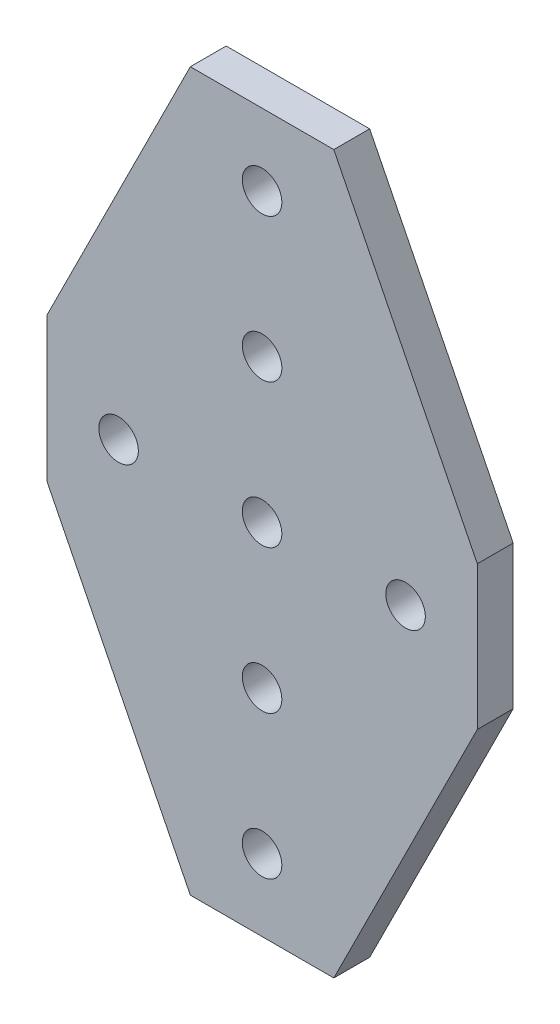
ISO-10303-21;
HEADER;
FILE_DESCRIPTION(('STEP AP214'),'2;1');
FILE_NAME('part.step','',(''),(''),'','','');
FILE_SCHEMA(('AUTOMOTIVE_DESIGN { 1 0 10303 214 1 1 1 1 }'));
ENDSEC;
DATA;
#1=APPLICATION_CONTEXT('core data for automotive mechanical design processes');
#2=APPLICATION_PROTOCOL_DEFINITION('international standard','automotive_design',2000,#1);
#3=PRODUCT_CONTEXT('',#1,'mechanical');
#4=PRODUCT('Part','Part','',(#3));
#5=PRODUCT_RELATED_PRODUCT_CATEGORY('part','',(#4));
#6=PRODUCT_DEFINITION_FORMATION('','',#4);
#7=PRODUCT_DEFINITION_CONTEXT('part definition',#1,'design');
#8=PRODUCT_DEFINITION('design','',#6,#7);
#9=PRODUCT_DEFINITION_SHAPE('','',#8);
#10=(LENGTH_UNIT() NAMED_UNIT(*) SI_UNIT(.MILLI.,.METRE.));
#11=(NAMED_UNIT(*) PLANE_ANGLE_UNIT() SI_UNIT($,.RADIAN.));
#12=(NAMED_UNIT(*) SI_UNIT($,.STERADIAN.) SOLID_ANGLE_UNIT());
#13=UNCERTAINTY_MEASURE_WITH_UNIT(LENGTH_MEASURE(1.E-05),#10,'distance_accuracy_value','');
#14=(GEOMETRIC_REPRESENTATION_CONTEXT(3) GLOBAL_UNCERTAINTY_ASSIGNED_CONTEXT((#13)) GLOBAL_UNIT_ASSIGNED_CONTEXT((#10,
#11,#12)) REPRESENTATION_CONTEXT('',''));
#15=CARTESIAN_POINT('',(0.,0.,0.));
#16=DIRECTION('',(0.,0.,1.));
#17=DIRECTION('',(1.,0.,0.));
#18=AXIS2_PLACEMENT_3D('',#15,#16,#17);
#19=CARTESIAN_POINT('',(0.,0.,6.35));
#20=DIRECTION('',(0.894427190999916,0.447213595499958,0.));
#21=DIRECTION('',(-0.447213595499958,0.894427190999916,0.));
#22=AXIS2_PLACEMENT_3D('',#19,#20,#21);
#23=PLANE('',#22);
#24=DIRECTION('',(0.447213595499958,-0.894427190999916,0.));
#25=VECTOR('',#24,1.);
#26=CARTESIAN_POINT('',(0.,0.,0.));
#27=LINE('',#26,#25);
#28=CARTESIAN_POINT('',(-25.4,50.8,0.));
#29=VERTEX_POINT('',#28);
#30=CARTESIAN_POINT('',(0.,0.,0.));
#31=VERTEX_POINT('',#30);
#32=EDGE_CURVE('E130',#29,#31,#27,.T.);
#33=ORIENTED_EDGE('',*,*,#32,.T.);
#34=DIRECTION('',(0.,0.,-1.));
#35=VECTOR('',#34,1.);
#36=CARTESIAN_POINT('',(0.,0.,6.35));
#37=LINE('',#36,#35);
#38=CARTESIAN_POINT('',(0.,0.,6.35));
#39=VERTEX_POINT('',#38);
#40=EDGE_CURVE('E11',#39,#31,#37,.T.);
#41=ORIENTED_EDGE('',*,*,#40,.F.);
#42=DIRECTION('',(0.447213595499958,-0.894427190999916,0.));
#43=VECTOR('',#42,1.);
#44=CARTESIAN_POINT('',(0.,0.,6.35));
#45=LINE('',#44,#43);
#46=CARTESIAN_POINT('',(-25.4,50.8,6.35));
#47=VERTEX_POINT('',#46);
#48=EDGE_CURVE('E145',#47,#39,#45,.T.);
#49=ORIENTED_EDGE('',*,*,#48,.F.);
#50=DIRECTION('',(0.,0.,-1.));
#51=VECTOR('',#50,1.);
#52=CARTESIAN_POINT('',(-25.4,50.8,6.35));
#53=LINE('',#52,#51);
#54=EDGE_CURVE('E126',#47,#29,#53,.T.);
#55=ORIENTED_EDGE('',*,*,#54,.T.);
#56=EDGE_LOOP('',(#33,#41,#49,#55));
#57=FACE_BOUND('',#56,.T.);
#58=ADVANCED_FACE('F34',(#57),#23,.F.);
#59=CARTESIAN_POINT('',(25.4,0.,6.35));
#60=DIRECTION('',(0.,1.,0.));
#61=DIRECTION('',(-1.,0.,0.));
#62=AXIS2_PLACEMENT_3D('',#59,#60,#61);
#63=PLANE('',#62);
#64=DIRECTION('',(1.,0.,0.));
#65=VECTOR('',#64,1.);
#66=CARTESIAN_POINT('',(25.4,0.,0.));
#67=LINE('',#66,#65);
#68=CARTESIAN_POINT('',(25.4,0.,0.));
#69=VERTEX_POINT('',#68);
#70=EDGE_CURVE('E133',#31,#69,#67,.T.);
#71=ORIENTED_EDGE('',*,*,#70,.T.);
#72=DIRECTION('',(0.,0.,-1.));
#73=VECTOR('',#72,1.);
#74=CARTESIAN_POINT('',(25.4,0.,6.35));
#75=LINE('',#74,#73);
#76=CARTESIAN_POINT('',(25.4,0.,6.35));
#77=VERTEX_POINT('',#76);
#78=EDGE_CURVE('E42',#77,#69,#75,.T.);
#79=ORIENTED_EDGE('',*,*,#78,.F.);
#80=DIRECTION('',(1.,0.,0.));
#81=VECTOR('',#80,1.);
#82=CARTESIAN_POINT('',(25.4,0.,6.35));
#83=LINE('',#82,#81);
#84=EDGE_CURVE('E93',#39,#77,#83,.T.);
#85=ORIENTED_EDGE('',*,*,#84,.F.);
#86=ORIENTED_EDGE('',*,*,#40,.T.);
#87=EDGE_LOOP('',(#71,#79,#85,#86));
#88=FACE_BOUND('',#87,.T.);
#89=ADVANCED_FACE('F248',(#88),#63,.F.);
#90=CARTESIAN_POINT('',(50.8,50.8,6.35));
#91=DIRECTION('',(-0.894427190999916,0.447213595499958,0.));
#92=DIRECTION('',(-0.447213595499958,-0.894427190999916,0.));
#93=AXIS2_PLACEMENT_3D('',#90,#91,#92);
#94=PLANE('',#93);
#95=DIRECTION('',(0.447213595499958,0.894427190999916,0.));
#96=VECTOR('',#95,1.);
#97=CARTESIAN_POINT('',(50.8,50.8,0.));
#98=LINE('',#97,#96);
#99=CARTESIAN_POINT('',(50.8,50.8,0.));
#100=VERTEX_POINT('',#99);
#101=EDGE_CURVE('E136',#69,#100,#98,.T.);
#102=ORIENTED_EDGE('',*,*,#101,.T.);
#103=DIRECTION('',(0.,0.,-1.));
#104=VECTOR('',#103,1.);
#105=CARTESIAN_POINT('',(50.8,50.8,6.35));
#106=LINE('',#105,#104);
#107=CARTESIAN_POINT('',(50.8,50.8,6.35));
#108=VERTEX_POINT('',#107);
#109=EDGE_CURVE('E152',#108,#100,#106,.T.);
#110=ORIENTED_EDGE('',*,*,#109,.F.);
#111=DIRECTION('',(0.447213595499958,0.894427190999916,0.));
#112=VECTOR('',#111,1.);
#113=CARTESIAN_POINT('',(50.8,50.8,6.35));
#114=LINE('',#113,#112);
#115=EDGE_CURVE('E160',#77,#108,#114,.T.);
#116=ORIENTED_EDGE('',*,*,#115,.F.);
#117=ORIENTED_EDGE('',*,*,#78,.T.);
#118=EDGE_LOOP('',(#102,#110,#116,#117));
#119=FACE_BOUND('',#118,.T.);
#120=ADVANCED_FACE('F158',(#119),#94,.F.);
#121=CARTESIAN_POINT('',(50.8,76.2,6.35));
#122=DIRECTION('',(-1.,0.,0.));
#123=DIRECTION('',(0.,-1.,0.));
#124=AXIS2_PLACEMENT_3D('',#121,#122,#123);
#125=PLANE('',#124);
#126=DIRECTION('',(0.,1.,0.));
#127=VECTOR('',#126,1.);
#128=CARTESIAN_POINT('',(50.8,76.2,0.));
#129=LINE('',#128,#127);
#130=CARTESIAN_POINT('',(50.8,76.2,0.));
#131=VERTEX_POINT('',#130);
#132=EDGE_CURVE('E138',#100,#131,#129,.T.);
#133=ORIENTED_EDGE('',*,*,#132,.T.);
#134=DIRECTION('',(0.,0.,-1.));
#135=VECTOR('',#134,1.);
#136=CARTESIAN_POINT('',(50.8,76.2,6.35));
#137=LINE('',#136,#135);
#138=CARTESIAN_POINT('',(50.8,76.2,6.35));
#139=VERTEX_POINT('',#138);
#140=EDGE_CURVE('E149',#139,#131,#137,.T.);
#141=ORIENTED_EDGE('',*,*,#140,.F.);
#142=DIRECTION('',(0.,1.,0.));
#143=VECTOR('',#142,1.);
#144=CARTESIAN_POINT('',(50.8,76.2,6.35));
#145=LINE('',#144,#143);
#146=EDGE_CURVE('E172',#108,#139,#145,.T.);
#147=ORIENTED_EDGE('',*,*,#146,.F.);
#148=ORIENTED_EDGE('',*,*,#109,.T.);
#149=EDGE_LOOP('',(#133,#141,#147,#148));
#150=FACE_BOUND('',#149,.T.);
#151=ADVANCED_FACE('F168',(#150),#125,.F.);
#152=CARTESIAN_POINT('',(25.4,127.,6.35));
#153=DIRECTION('',(-0.894427190999916,-0.447213595499958,0.));
#154=DIRECTION('',(0.447213595499958,-0.894427190999916,0.));
#155=AXIS2_PLACEMENT_3D('',#152,#153,#154);
#156=PLANE('',#155);
#157=DIRECTION('',(-0.447213595499958,0.894427190999916,0.));
#158=VECTOR('',#157,1.);
#159=CARTESIAN_POINT('',(25.4,127.,0.));
#160=LINE('',#159,#158);
#161=CARTESIAN_POINT('',(25.4,127.,0.));
#162=VERTEX_POINT('',#161);
#163=EDGE_CURVE('E140',#131,#162,#160,.T.);
#164=ORIENTED_EDGE('',*,*,#163,.T.);
#165=DIRECTION('',(0.,0.,-1.));
#166=VECTOR('',#165,1.);
#167=CARTESIAN_POINT('',(25.4,127.,6.35));
#168=LINE('',#167,#166);
#169=CARTESIAN_POINT('',(25.4,127.,6.35));
#170=VERTEX_POINT('',#169);
#171=EDGE_CURVE('E121',#170,#162,#168,.T.);
#172=ORIENTED_EDGE('',*,*,#171,.F.);
#173=DIRECTION('',(-0.447213595499958,0.894427190999916,0.));
#174=VECTOR('',#173,1.);
#175=CARTESIAN_POINT('',(25.4,127.,6.35));
#176=LINE('',#175,#174);
#177=EDGE_CURVE('E112',#139,#170,#176,.T.);
#178=ORIENTED_EDGE('',*,*,#177,.F.);
#179=ORIENTED_EDGE('',*,*,#140,.T.);
#180=EDGE_LOOP('',(#164,#172,#178,#179));
#181=FACE_BOUND('',#180,.T.);
#182=ADVANCED_FACE('F171',(#181),#156,.F.);
#183=CARTESIAN_POINT('',(0.,127.,6.35));
#184=DIRECTION('',(0.,-1.,0.));
#185=DIRECTION('',(0.,0.,-1.));
#186=AXIS2_PLACEMENT_3D('',#183,#184,#185);
#187=PLANE('',#186);
#188=DIRECTION('',(-1.,0.,0.));
#189=VECTOR('',#188,1.);
#190=CARTESIAN_POINT('',(0.,127.,0.));
#191=LINE('',#190,#189);
#192=CARTESIAN_POINT('',(0.,127.,0.));
#193=VERTEX_POINT('',#192);
#194=EDGE_CURVE('E120',#162,#193,#191,.T.);
#195=ORIENTED_EDGE('',*,*,#194,.T.);
#196=DIRECTION('',(0.,0.,-1.));
#197=VECTOR('',#196,1.);
#198=CARTESIAN_POINT('',(0.,127.,6.35));
#199=LINE('',#198,#197);
#200=CARTESIAN_POINT('',(0.,127.,6.35));
#201=VERTEX_POINT('',#200);
#202=EDGE_CURVE('E117',#201,#193,#199,.T.);
#203=ORIENTED_EDGE('',*,*,#202,.F.);
#204=DIRECTION('',(-1.,0.,0.));
#205=VECTOR('',#204,1.);
#206=CARTESIAN_POINT('',(0.,127.,6.35));
#207=LINE('',#206,#205);
#208=EDGE_CURVE('E106',#170,#201,#207,.T.);
#209=ORIENTED_EDGE('',*,*,#208,.F.);
#210=ORIENTED_EDGE('',*,*,#171,.T.);
#211=EDGE_LOOP('',(#195,#203,#209,#210));
#212=FACE_BOUND('',#211,.T.);
#213=ADVANCED_FACE('F118',(#212),#187,.F.);
#214=CARTESIAN_POINT('',(-25.4,76.2,6.35));
#215=DIRECTION('',(0.894427190999916,-0.447213595499958,0.));
#216=DIRECTION('',(0.447213595499958,0.894427190999916,0.));
#217=AXIS2_PLACEMENT_3D('',#214,#215,#216);
#218=PLANE('',#217);
#219=DIRECTION('',(-0.447213595499958,-0.894427190999916,0.));
#220=VECTOR('',#219,1.);
#221=CARTESIAN_POINT('',(-25.4,76.2,0.));
#222=LINE('',#221,#220);
#223=CARTESIAN_POINT('',(-25.4,76.2,0.));
#224=VERTEX_POINT('',#223);
#225=EDGE_CURVE('E79',#193,#224,#222,.T.);
#226=ORIENTED_EDGE('',*,*,#225,.T.);
#227=DIRECTION('',(0.,0.,-1.));
#228=VECTOR('',#227,1.);
#229=CARTESIAN_POINT('',(-25.4,76.2,6.35));
#230=LINE('',#229,#228);
#231=CARTESIAN_POINT('',(-25.4,76.2,6.35));
#232=VERTEX_POINT('',#231);
#233=EDGE_CURVE('E122',#232,#224,#230,.T.);
#234=ORIENTED_EDGE('',*,*,#233,.F.);
#235=DIRECTION('',(-0.447213595499958,-0.894427190999916,0.));
#236=VECTOR('',#235,1.);
#237=CARTESIAN_POINT('',(-25.4,76.2,6.35));
#238=LINE('',#237,#236);
#239=EDGE_CURVE('E110',#201,#232,#238,.T.);
#240=ORIENTED_EDGE('',*,*,#239,.F.);
#241=ORIENTED_EDGE('',*,*,#202,.T.);
#242=EDGE_LOOP('',(#226,#234,#240,#241));
#243=FACE_BOUND('',#242,.T.);
#244=ADVANCED_FACE('F124',(#243),#218,.F.);
#245=CARTESIAN_POINT('',(-25.4,50.8,6.35));
#246=DIRECTION('',(1.,0.,0.));
#247=DIRECTION('',(0.,0.,-1.));
#248=AXIS2_PLACEMENT_3D('',#245,#246,#247);
#249=PLANE('',#248);
#250=DIRECTION('',(0.,-1.,0.));
#251=VECTOR('',#250,1.);
#252=CARTESIAN_POINT('',(-25.4,50.8,0.));
#253=LINE('',#252,#251);
#254=EDGE_CURVE('E85',#224,#29,#253,.T.);
#255=ORIENTED_EDGE('',*,*,#254,.T.);
#256=ORIENTED_EDGE('',*,*,#54,.F.);
#257=DIRECTION('',(0.,-1.,0.));
#258=VECTOR('',#257,1.);
#259=CARTESIAN_POINT('',(-25.4,50.8,6.35));
#260=LINE('',#259,#258);
#261=EDGE_CURVE('E50',#232,#47,#260,.T.);
#262=ORIENTED_EDGE('',*,*,#261,.F.);
#263=ORIENTED_EDGE('',*,*,#233,.T.);
#264=EDGE_LOOP('',(#255,#256,#262,#263));
#265=FACE_BOUND('',#264,.T.);
#266=ADVANCED_FACE('F232',(#265),#249,.F.);
#267=CARTESIAN_POINT('',(0.,0.,6.35));
#268=DIRECTION('',(0.,0.,-1.));
#269=DIRECTION('',(-1.,0.,0.));
#270=AXIS2_PLACEMENT_3D('',#267,#268,#269);
#271=PLANE('',#270);
#272=CARTESIAN_POINT('',(12.7000000000003,88.9,6.35));
#273=DIRECTION('',(0.,0.,1.));
#274=DIRECTION('',(-1.,0.,0.));
#275=AXIS2_PLACEMENT_3D('',#272,#273,#274);
#276=CIRCLE('',#275,3.5);
#277=CARTESIAN_POINT('',(9.20000000000027,88.9,6.35));
#278=VERTEX_POINT('',#277);
#279=EDGE_CURVE('E184',#278,#278,#276,.T.);
#280=ORIENTED_EDGE('',*,*,#279,.F.);
#281=EDGE_LOOP('',(#280));
#282=FACE_BOUND('',#281,.T.);
#283=CARTESIAN_POINT('',(12.7000000000005,114.3,6.35));
#284=DIRECTION('',(0.,0.,1.));
#285=DIRECTION('',(-1.,0.,0.));
#286=AXIS2_PLACEMENT_3D('',#283,#284,#285);
#287=CIRCLE('',#286,3.5);
#288=CARTESIAN_POINT('',(9.20000000000053,114.3,6.35));
#289=VERTEX_POINT('',#288);
#290=EDGE_CURVE('E190',#289,#289,#287,.T.);
#291=ORIENTED_EDGE('',*,*,#290,.F.);
#292=EDGE_LOOP('',(#291));
#293=FACE_BOUND('',#292,.T.);
#294=CARTESIAN_POINT('',(12.7000000000005,12.7,6.35));
#295=DIRECTION('',(0.,0.,1.));
#296=DIRECTION('',(1.,0.,0.));
#297=AXIS2_PLACEMENT_3D('',#294,#295,#296);
#298=CIRCLE('',#297,3.5);
#299=CARTESIAN_POINT('',(16.2000000000005,12.7,6.35));
#300=VERTEX_POINT('',#299);
#301=EDGE_CURVE('E196',#300,#300,#298,.T.);
#302=ORIENTED_EDGE('',*,*,#301,.F.);
#303=EDGE_LOOP('',(#302));
#304=FACE_BOUND('',#303,.T.);
#305=CARTESIAN_POINT('',(12.7000000000003,38.1,6.35));
#306=DIRECTION('',(0.,0.,1.));
#307=DIRECTION('',(1.,0.,0.));
#308=AXIS2_PLACEMENT_3D('',#305,#306,#307);
#309=CIRCLE('',#308,3.5);
#310=CARTESIAN_POINT('',(16.2000000000003,38.1,6.35));
#311=VERTEX_POINT('',#310);
#312=EDGE_CURVE('E202',#311,#311,#309,.T.);
#313=ORIENTED_EDGE('',*,*,#312,.F.);
#314=EDGE_LOOP('',(#313));
#315=FACE_BOUND('',#314,.T.);
#316=CARTESIAN_POINT('',(-12.7,63.5000000000004,6.35));
#317=DIRECTION('',(0.,0.,1.));
#318=DIRECTION('',(-1.,0.,0.));
#319=AXIS2_PLACEMENT_3D('',#316,#317,#318);
#320=CIRCLE('',#319,3.5);
#321=CARTESIAN_POINT('',(-16.2,63.5000000000004,6.35));
#322=VERTEX_POINT('',#321);
#323=EDGE_CURVE('E208',#322,#322,#320,.T.);
#324=ORIENTED_EDGE('',*,*,#323,.F.);
#325=EDGE_LOOP('',(#324));
#326=FACE_BOUND('',#325,.T.);
#327=CARTESIAN_POINT('',(38.1,63.5000000000004,6.35));
#328=DIRECTION('',(0.,0.,1.));
#329=DIRECTION('',(1.,0.,0.));
#330=AXIS2_PLACEMENT_3D('',#327,#328,#329);
#331=CIRCLE('',#330,3.5);
#332=CARTESIAN_POINT('',(41.6,63.5000000000004,6.35));
#333=VERTEX_POINT('',#332);
#334=EDGE_CURVE('E214',#333,#333,#331,.T.);
#335=ORIENTED_EDGE('',*,*,#334,.F.);
#336=EDGE_LOOP('',(#335));
#337=FACE_BOUND('',#336,.T.);
#338=CARTESIAN_POINT('',(12.7,63.5,6.35));
#339=DIRECTION('',(0.,0.,1.));
#340=DIRECTION('',(1.,0.,0.));
#341=AXIS2_PLACEMENT_3D('',#338,#339,#340);
#342=CIRCLE('',#341,3.5);
#343=CARTESIAN_POINT('',(16.2,63.5,6.35));
#344=VERTEX_POINT('',#343);
#345=EDGE_CURVE('E178',#344,#344,#342,.T.);
#346=ORIENTED_EDGE('',*,*,#345,.F.);
#347=EDGE_LOOP('',(#346));
#348=FACE_BOUND('',#347,.T.);
#349=ORIENTED_EDGE('',*,*,#48,.T.);
#350=ORIENTED_EDGE('',*,*,#84,.T.);
#351=ORIENTED_EDGE('',*,*,#115,.T.);
#352=ORIENTED_EDGE('',*,*,#146,.T.);
#353=ORIENTED_EDGE('',*,*,#177,.T.);
#354=ORIENTED_EDGE('',*,*,#208,.T.);
#355=ORIENTED_EDGE('',*,*,#239,.T.);
#356=ORIENTED_EDGE('',*,*,#261,.T.);
#357=EDGE_LOOP('',(#349,#350,#351,#352,#353,#354,#355,#356));
#358=FACE_BOUND('',#357,.T.);
#359=ADVANCED_FACE('F108',(#282,#293,#304,#315,#326,#337,#348,#358),#271,.F.);
#360=CARTESIAN_POINT('',(0.,0.,0.));
#361=DIRECTION('',(0.,0.,-1.));
#362=DIRECTION('',(-1.,0.,0.));
#363=AXIS2_PLACEMENT_3D('',#360,#361,#362);
#364=PLANE('',#363);
#365=CARTESIAN_POINT('',(12.7000000000003,88.9,0.));
#366=DIRECTION('',(0.,0.,1.));
#367=DIRECTION('',(-1.,0.,0.));
#368=AXIS2_PLACEMENT_3D('',#365,#366,#367);
#369=CIRCLE('',#368,3.5);
#370=CARTESIAN_POINT('',(9.20000000000027,88.9,0.));
#371=VERTEX_POINT('',#370);
#372=EDGE_CURVE('E187',#371,#371,#369,.T.);
#373=ORIENTED_EDGE('',*,*,#372,.T.);
#374=EDGE_LOOP('',(#373));
#375=FACE_BOUND('',#374,.T.);
#376=CARTESIAN_POINT('',(12.7000000000005,114.3,0.));
#377=DIRECTION('',(0.,0.,1.));
#378=DIRECTION('',(-1.,0.,0.));
#379=AXIS2_PLACEMENT_3D('',#376,#377,#378);
#380=CIRCLE('',#379,3.5);
#381=CARTESIAN_POINT('',(9.20000000000053,114.3,0.));
#382=VERTEX_POINT('',#381);
#383=EDGE_CURVE('E193',#382,#382,#380,.T.);
#384=ORIENTED_EDGE('',*,*,#383,.T.);
#385=EDGE_LOOP('',(#384));
#386=FACE_BOUND('',#385,.T.);
#387=CARTESIAN_POINT('',(12.7000000000005,12.7,0.));
#388=DIRECTION('',(0.,0.,1.));
#389=DIRECTION('',(1.,0.,0.));
#390=AXIS2_PLACEMENT_3D('',#387,#388,#389);
#391=CIRCLE('',#390,3.5);
#392=CARTESIAN_POINT('',(16.2000000000005,12.7,0.));
#393=VERTEX_POINT('',#392);
#394=EDGE_CURVE('E199',#393,#393,#391,.T.);
#395=ORIENTED_EDGE('',*,*,#394,.T.);
#396=EDGE_LOOP('',(#395));
#397=FACE_BOUND('',#396,.T.);
#398=CARTESIAN_POINT('',(12.7000000000003,38.1,0.));
#399=DIRECTION('',(0.,0.,1.));
#400=DIRECTION('',(1.,0.,0.));
#401=AXIS2_PLACEMENT_3D('',#398,#399,#400);
#402=CIRCLE('',#401,3.5);
#403=CARTESIAN_POINT('',(16.2000000000003,38.1,0.));
#404=VERTEX_POINT('',#403);
#405=EDGE_CURVE('E205',#404,#404,#402,.T.);
#406=ORIENTED_EDGE('',*,*,#405,.T.);
#407=EDGE_LOOP('',(#406));
#408=FACE_BOUND('',#407,.T.);
#409=CARTESIAN_POINT('',(-12.7,63.5000000000004,0.));
#410=DIRECTION('',(0.,0.,1.));
#411=DIRECTION('',(-1.,0.,0.));
#412=AXIS2_PLACEMENT_3D('',#409,#410,#411);
#413=CIRCLE('',#412,3.5);
#414=CARTESIAN_POINT('',(-16.2,63.5000000000004,0.));
#415=VERTEX_POINT('',#414);
#416=EDGE_CURVE('E211',#415,#415,#413,.T.);
#417=ORIENTED_EDGE('',*,*,#416,.T.);
#418=EDGE_LOOP('',(#417));
#419=FACE_BOUND('',#418,.T.);
#420=CARTESIAN_POINT('',(38.1,63.5000000000004,0.));
#421=DIRECTION('',(0.,0.,1.));
#422=DIRECTION('',(1.,0.,0.));
#423=AXIS2_PLACEMENT_3D('',#420,#421,#422);
#424=CIRCLE('',#423,3.5);
#425=CARTESIAN_POINT('',(41.6,63.5000000000004,0.));
#426=VERTEX_POINT('',#425);
#427=EDGE_CURVE('E181',#426,#426,#424,.T.);
#428=ORIENTED_EDGE('',*,*,#427,.T.);
#429=EDGE_LOOP('',(#428));
#430=FACE_BOUND('',#429,.T.);
#431=CARTESIAN_POINT('',(12.7,63.5,0.));
#432=DIRECTION('',(0.,0.,1.));
#433=DIRECTION('',(1.,0.,0.));
#434=AXIS2_PLACEMENT_3D('',#431,#432,#433);
#435=CIRCLE('',#434,3.5);
#436=CARTESIAN_POINT('',(16.2,63.5,0.));
#437=VERTEX_POINT('',#436);
#438=EDGE_CURVE('E134',#437,#437,#435,.T.);
#439=ORIENTED_EDGE('',*,*,#438,.T.);
#440=EDGE_LOOP('',(#439));
#441=FACE_BOUND('',#440,.T.);
#442=ORIENTED_EDGE('',*,*,#32,.F.);
#443=ORIENTED_EDGE('',*,*,#254,.F.);
#444=ORIENTED_EDGE('',*,*,#225,.F.);
#445=ORIENTED_EDGE('',*,*,#194,.F.);
#446=ORIENTED_EDGE('',*,*,#163,.F.);
#447=ORIENTED_EDGE('',*,*,#132,.F.);
#448=ORIENTED_EDGE('',*,*,#101,.F.);
#449=ORIENTED_EDGE('',*,*,#70,.F.);
#450=EDGE_LOOP('',(#442,#443,#444,#445,#446,#447,#448,#449));
#451=FACE_BOUND('',#450,.T.);
#452=ADVANCED_FACE('F164',(#375,#386,#397,#408,#419,#430,#441,#451),#364,.T.);
#453=CARTESIAN_POINT('',(12.7,63.5,0.));
#454=DIRECTION('',(0.,0.,1.));
#455=DIRECTION('',(1.,0.,0.));
#456=AXIS2_PLACEMENT_3D('',#453,#454,#455);
#457=CYLINDRICAL_SURFACE('',#456,3.5);
#458=ORIENTED_EDGE('',*,*,#438,.F.);
#459=EDGE_LOOP('',(#458));
#460=FACE_BOUND('',#459,.T.);
#461=ORIENTED_EDGE('',*,*,#345,.T.);
#462=EDGE_LOOP('',(#461));
#463=FACE_BOUND('',#462,.T.);
#464=ADVANCED_FACE('F226',(#460,#463),#457,.F.);
#465=CARTESIAN_POINT('',(38.1,63.5000000000004,0.));
#466=DIRECTION('',(0.,0.,1.));
#467=DIRECTION('',(1.,0.,0.));
#468=AXIS2_PLACEMENT_3D('',#465,#466,#467);
#469=CYLINDRICAL_SURFACE('',#468,3.5);
#470=ORIENTED_EDGE('',*,*,#427,.F.);
#471=EDGE_LOOP('',(#470));
#472=FACE_BOUND('',#471,.T.);
#473=ORIENTED_EDGE('',*,*,#334,.T.);
#474=EDGE_LOOP('',(#473));
#475=FACE_BOUND('',#474,.T.);
#476=ADVANCED_FACE('F222',(#472,#475),#469,.F.);
#477=CARTESIAN_POINT('',(-12.7,63.5000000000004,0.));
#478=DIRECTION('',(0.,0.,1.));
#479=DIRECTION('',(1.,0.,0.));
#480=AXIS2_PLACEMENT_3D('',#477,#478,#479);
#481=CYLINDRICAL_SURFACE('',#480,3.5);
#482=ORIENTED_EDGE('',*,*,#416,.F.);
#483=EDGE_LOOP('',(#482));
#484=FACE_BOUND('',#483,.T.);
#485=ORIENTED_EDGE('',*,*,#323,.T.);
#486=EDGE_LOOP('',(#485));
#487=FACE_BOUND('',#486,.T.);
#488=ADVANCED_FACE('F225',(#484,#487),#481,.F.);
#489=CARTESIAN_POINT('',(12.7000000000003,38.1,0.));
#490=DIRECTION('',(0.,0.,1.));
#491=DIRECTION('',(1.,0.,0.));
#492=AXIS2_PLACEMENT_3D('',#489,#490,#491);
#493=CYLINDRICAL_SURFACE('',#492,3.5);
#494=ORIENTED_EDGE('',*,*,#405,.F.);
#495=EDGE_LOOP('',(#494));
#496=FACE_BOUND('',#495,.T.);
#497=ORIENTED_EDGE('',*,*,#312,.T.);
#498=EDGE_LOOP('',(#497));
#499=FACE_BOUND('',#498,.T.);
#500=ADVANCED_FACE('F324',(#496,#499),#493,.F.);
#501=CARTESIAN_POINT('',(12.7000000000005,12.7,0.));
#502=DIRECTION('',(0.,0.,1.));
#503=DIRECTION('',(1.,0.,0.));
#504=AXIS2_PLACEMENT_3D('',#501,#502,#503);
#505=CYLINDRICAL_SURFACE('',#504,3.5);
#506=ORIENTED_EDGE('',*,*,#394,.F.);
#507=EDGE_LOOP('',(#506));
#508=FACE_BOUND('',#507,.T.);
#509=ORIENTED_EDGE('',*,*,#301,.T.);
#510=EDGE_LOOP('',(#509));
#511=FACE_BOUND('',#510,.T.);
#512=ADVANCED_FACE('F334',(#508,#511),#505,.F.);
#513=CARTESIAN_POINT('',(12.7000000000005,114.3,0.));
#514=DIRECTION('',(0.,0.,1.));
#515=DIRECTION('',(1.,0.,0.));
#516=AXIS2_PLACEMENT_3D('',#513,#514,#515);
#517=CYLINDRICAL_SURFACE('',#516,3.5);
#518=ORIENTED_EDGE('',*,*,#383,.F.);
#519=EDGE_LOOP('',(#518));
#520=FACE_BOUND('',#519,.T.);
#521=ORIENTED_EDGE('',*,*,#290,.T.);
#522=EDGE_LOOP('',(#521));
#523=FACE_BOUND('',#522,.T.);
#524=ADVANCED_FACE('F344',(#520,#523),#517,.F.);
#525=CARTESIAN_POINT('',(12.7000000000003,88.9,0.));
#526=DIRECTION('',(0.,0.,1.));
#527=DIRECTION('',(1.,0.,0.));
#528=AXIS2_PLACEMENT_3D('',#525,#526,#527);
#529=CYLINDRICAL_SURFACE('',#528,3.5);
#530=ORIENTED_EDGE('',*,*,#372,.F.);
#531=EDGE_LOOP('',(#530));
#532=FACE_BOUND('',#531,.T.);
#533=ORIENTED_EDGE('',*,*,#279,.T.);
#534=EDGE_LOOP('',(#533));
#535=FACE_BOUND('',#534,.T.);
#536=ADVANCED_FACE('F354',(#532,#535),#529,.F.);
#537=CLOSED_SHELL('',(#58,#89,#120,#151,#182,#213,#244,#266,#359,#452,#464,#476,#488,#500,#512,
#524,#536));
#538=MANIFOLD_SOLID_BREP('B2',#537);
#539=ADVANCED_BREP_SHAPE_REPRESENTATION('',(#18,#538),#14);
#540=SHAPE_DEFINITION_REPRESENTATION(#9,#539);
ENDSEC;
END-ISO-10303-21;
